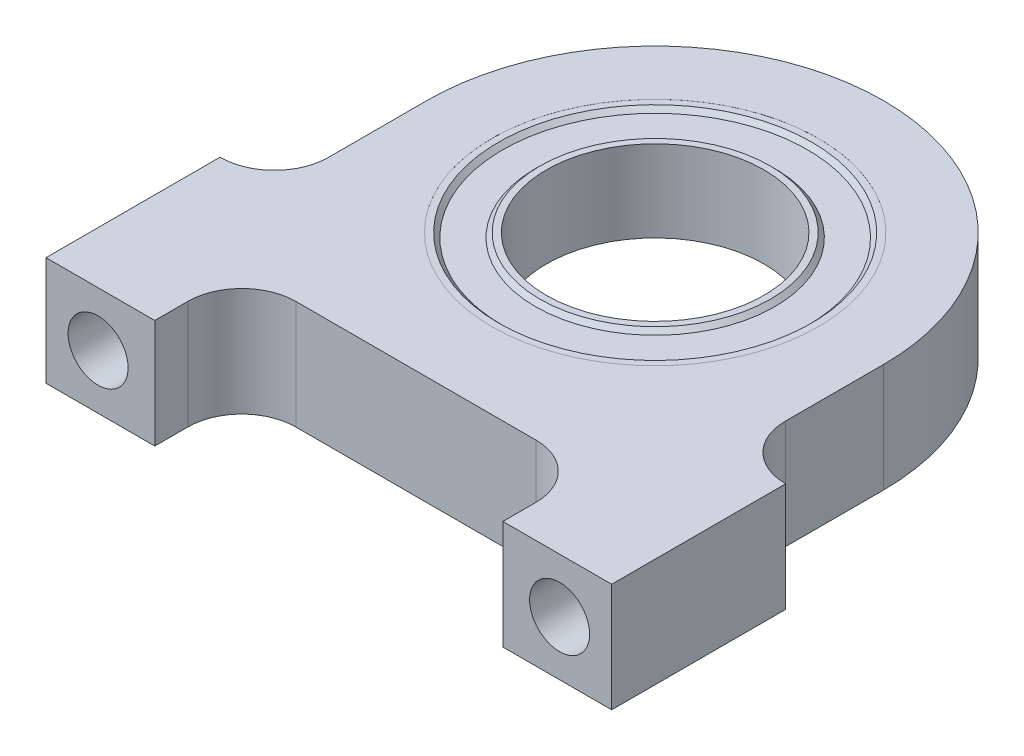
ISO-10303-21;
HEADER;
FILE_DESCRIPTION(('STEP AP214'),'2;1');
FILE_NAME('part.step','',(''),(''),'','','');
FILE_SCHEMA(('AUTOMOTIVE_DESIGN { 1 0 10303 214 1 1 1 1 }'));
ENDSEC;
DATA;
#1=APPLICATION_CONTEXT('core data for automotive mechanical design processes');
#2=APPLICATION_PROTOCOL_DEFINITION('international standard','automotive_design',2000,#1);
#3=PRODUCT_CONTEXT('',#1,'mechanical');
#4=PRODUCT('Part','Part','',(#3));
#5=PRODUCT_RELATED_PRODUCT_CATEGORY('part','',(#4));
#6=PRODUCT_DEFINITION_FORMATION('','',#4);
#7=PRODUCT_DEFINITION_CONTEXT('part definition',#1,'design');
#8=PRODUCT_DEFINITION('design','',#6,#7);
#9=PRODUCT_DEFINITION_SHAPE('','',#8);
#10=(LENGTH_UNIT() NAMED_UNIT(*) SI_UNIT(.MILLI.,.METRE.));
#11=(NAMED_UNIT(*) PLANE_ANGLE_UNIT() SI_UNIT($,.RADIAN.));
#12=(NAMED_UNIT(*) SI_UNIT($,.STERADIAN.) SOLID_ANGLE_UNIT());
#13=UNCERTAINTY_MEASURE_WITH_UNIT(LENGTH_MEASURE(1.E-05),#10,'distance_accuracy_value','');
#14=(GEOMETRIC_REPRESENTATION_CONTEXT(3) GLOBAL_UNCERTAINTY_ASSIGNED_CONTEXT((#13)) GLOBAL_UNIT_ASSIGNED_CONTEXT((#10,
#11,#12)) REPRESENTATION_CONTEXT('',''));
#15=CARTESIAN_POINT('',(0.,0.,0.));
#16=DIRECTION('',(0.,0.,1.));
#17=DIRECTION('',(1.,0.,0.));
#18=AXIS2_PLACEMENT_3D('',#15,#16,#17);
#19=CARTESIAN_POINT('',(0.,6.34746,0.));
#20=DIRECTION('',(0.,-1.,0.));
#21=DIRECTION('',(0.,0.,-1.));
#22=AXIS2_PLACEMENT_3D('',#19,#20,#21);
#23=CYLINDRICAL_SURFACE('',#22,8.89);
#24=CARTESIAN_POINT('',(0.,1.5875,0.));
#25=DIRECTION('',(0.,1.,0.));
#26=DIRECTION('',(0.,0.,1.));
#27=AXIS2_PLACEMENT_3D('',#24,#25,#26);
#28=CIRCLE('',#27,8.89);
#29=CARTESIAN_POINT('',(0.,1.5875,8.89));
#30=VERTEX_POINT('',#29);
#31=EDGE_CURVE('E253',#30,#30,#28,.F.);
#32=ORIENTED_EDGE('',*,*,#31,.T.);
#33=EDGE_LOOP('',(#32));
#34=FACE_BOUND('',#33,.T.);
#35=CARTESIAN_POINT('',(0.,1.8415,0.));
#36=DIRECTION('',(0.,1.,0.));
#37=DIRECTION('',(0.,0.,1.));
#38=AXIS2_PLACEMENT_3D('',#35,#36,#37);
#39=CIRCLE('',#38,8.89);
#40=CARTESIAN_POINT('',(0.,1.8415,8.89));
#41=VERTEX_POINT('',#40);
#42=EDGE_CURVE('E429',#41,#41,#39,.T.);
#43=ORIENTED_EDGE('',*,*,#42,.T.);
#44=EDGE_LOOP('',(#43));
#45=FACE_BOUND('',#44,.T.);
#46=ADVANCED_FACE('F34',(#34,#45),#23,.F.);
#47=CARTESIAN_POINT('',(0.,6.35,0.));
#48=DIRECTION('',(0.,-1.,0.));
#49=DIRECTION('',(0.,0.,-1.));
#50=AXIS2_PLACEMENT_3D('',#47,#48,#49);
#51=CYLINDRICAL_SURFACE('',#50,8.73125);
#52=CARTESIAN_POINT('',(0.,0.,0.));
#53=DIRECTION('',(0.,1.,0.));
#54=DIRECTION('',(0.,0.,1.));
#55=AXIS2_PLACEMENT_3D('',#52,#53,#54);
#56=CIRCLE('',#55,8.73125);
#57=CARTESIAN_POINT('',(0.,0.,8.73125));
#58=VERTEX_POINT('',#57);
#59=EDGE_CURVE('E187',#58,#58,#56,.T.);
#60=ORIENTED_EDGE('',*,*,#59,.F.);
#61=EDGE_LOOP('',(#60));
#62=FACE_BOUND('',#61,.T.);
#63=CARTESIAN_POINT('',(0.,1.5875,0.));
#64=DIRECTION('',(0.,1.,0.));
#65=DIRECTION('',(0.,0.,1.));
#66=AXIS2_PLACEMENT_3D('',#63,#64,#65);
#67=CIRCLE('',#66,8.73125);
#68=CARTESIAN_POINT('',(0.,1.5875,8.73125));
#69=VERTEX_POINT('',#68);
#70=EDGE_CURVE('E254',#69,#69,#67,.T.);
#71=ORIENTED_EDGE('',*,*,#70,.T.);
#72=EDGE_LOOP('',(#71));
#73=FACE_BOUND('',#72,.T.);
#74=ADVANCED_FACE('F279',(#62,#73),#51,.F.);
#75=CARTESIAN_POINT('',(-7.0104,6.35,17.1196));
#76=DIRECTION('',(0.,-1.,0.));
#77=DIRECTION('',(0.,0.,-1.));
#78=AXIS2_PLACEMENT_3D('',#75,#76,#77);
#79=PLANE('',#78);
#80=CARTESIAN_POINT('',(0.,6.35,0.));
#81=DIRECTION('',(0.,1.,0.));
#82=DIRECTION('',(0.,0.,1.));
#83=AXIS2_PLACEMENT_3D('',#80,#81,#82);
#84=CIRCLE('',#83,9.525);
#85=CARTESIAN_POINT('',(0.,6.35,9.525));
#86=VERTEX_POINT('',#85);
#87=EDGE_CURVE('E257',#86,#86,#84,.T.);
#88=ORIENTED_EDGE('',*,*,#87,.F.);
#89=EDGE_LOOP('',(#88));
#90=FACE_BOUND('',#89,.T.);
#91=DIRECTION('',(0.,0.,-1.));
#92=VECTOR('',#91,1.);
#93=CARTESIAN_POINT('',(-10.16,6.35,19.05));
#94=LINE('',#93,#92);
#95=CARTESIAN_POINT('',(-10.16,6.35,19.05));
#96=VERTEX_POINT('',#95);
#97=CARTESIAN_POINT('',(-10.16,6.35,17.1196));
#98=VERTEX_POINT('',#97);
#99=EDGE_CURVE('E214',#96,#98,#94,.T.);
#100=ORIENTED_EDGE('',*,*,#99,.T.);
#101=CARTESIAN_POINT('',(-7.0104,6.35,17.1196));
#102=DIRECTION('',(0.,-1.,0.));
#103=DIRECTION('',(0.,0.,-1.));
#104=AXIS2_PLACEMENT_3D('',#101,#102,#103);
#105=CIRCLE('',#104,3.1496);
#106=CARTESIAN_POINT('',(-7.0104,6.35,13.97));
#107=VERTEX_POINT('',#106);
#108=EDGE_CURVE('E120',#98,#107,#105,.T.);
#109=ORIENTED_EDGE('',*,*,#108,.T.);
#110=DIRECTION('',(1.,0.,0.));
#111=VECTOR('',#110,1.);
#112=CARTESIAN_POINT('',(-7.0104,6.35,13.97));
#113=LINE('',#112,#111);
#114=CARTESIAN_POINT('',(7.01040000000001,6.35,13.97));
#115=VERTEX_POINT('',#114);
#116=EDGE_CURVE('E371',#107,#115,#113,.T.);
#117=ORIENTED_EDGE('',*,*,#116,.T.);
#118=CARTESIAN_POINT('',(7.0104,6.35,17.1196));
#119=DIRECTION('',(0.,-1.,0.));
#120=DIRECTION('',(0.,0.,-1.));
#121=AXIS2_PLACEMENT_3D('',#118,#119,#120);
#122=CIRCLE('',#121,3.1496);
#123=CARTESIAN_POINT('',(10.16,6.35,17.1196));
#124=VERTEX_POINT('',#123);
#125=EDGE_CURVE('E373',#115,#124,#122,.T.);
#126=ORIENTED_EDGE('',*,*,#125,.T.);
#127=DIRECTION('',(0.,0.,1.));
#128=VECTOR('',#127,1.);
#129=CARTESIAN_POINT('',(10.16,6.35,17.1196));
#130=LINE('',#129,#128);
#131=CARTESIAN_POINT('',(10.16,6.35,19.05));
#132=VERTEX_POINT('',#131);
#133=EDGE_CURVE('E375',#124,#132,#130,.T.);
#134=ORIENTED_EDGE('',*,*,#133,.T.);
#135=DIRECTION('',(1.,0.,0.));
#136=VECTOR('',#135,1.);
#137=CARTESIAN_POINT('',(10.16,6.35,19.05));
#138=LINE('',#137,#136);
#139=CARTESIAN_POINT('',(16.51,6.35,19.05));
#140=VERTEX_POINT('',#139);
#141=EDGE_CURVE('E381',#132,#140,#138,.T.);
#142=ORIENTED_EDGE('',*,*,#141,.T.);
#143=DIRECTION('',(0.,0.,-1.));
#144=VECTOR('',#143,1.);
#145=CARTESIAN_POINT('',(16.51,6.35,19.05));
#146=LINE('',#145,#144);
#147=CARTESIAN_POINT('',(16.51,6.35,8.89));
#148=VERTEX_POINT('',#147);
#149=EDGE_CURVE('E383',#140,#148,#146,.T.);
#150=ORIENTED_EDGE('',*,*,#149,.T.);
#151=DIRECTION('',(-1.,0.,0.));
#152=VECTOR('',#151,1.);
#153=CARTESIAN_POINT('',(16.4846,6.35,8.89));
#154=LINE('',#153,#152);
#155=CARTESIAN_POINT('',(16.4846,6.35,8.89));
#156=VERTEX_POINT('',#155);
#157=EDGE_CURVE('E385',#148,#156,#154,.T.);
#158=ORIENTED_EDGE('',*,*,#157,.T.);
#159=CARTESIAN_POINT('',(16.4846,6.35,5.7404));
#160=DIRECTION('',(0.,-1.,0.));
#161=DIRECTION('',(0.,0.,1.));
#162=AXIS2_PLACEMENT_3D('',#159,#160,#161);
#163=CIRCLE('',#162,3.1496);
#164=CARTESIAN_POINT('',(13.335,6.35,5.74039999999998));
#165=VERTEX_POINT('',#164);
#166=EDGE_CURVE('E387',#156,#165,#163,.T.);
#167=ORIENTED_EDGE('',*,*,#166,.T.);
#168=DIRECTION('',(0.,0.,-1.));
#169=VECTOR('',#168,1.);
#170=CARTESIAN_POINT('',(13.335,6.35,0.));
#171=LINE('',#170,#169);
#172=CARTESIAN_POINT('',(13.335,6.35,0.));
#173=VERTEX_POINT('',#172);
#174=EDGE_CURVE('E389',#165,#173,#171,.T.);
#175=ORIENTED_EDGE('',*,*,#174,.T.);
#176=CARTESIAN_POINT('',(0.,6.35,0.));
#177=DIRECTION('',(0.,1.,0.));
#178=DIRECTION('',(0.,0.,1.));
#179=AXIS2_PLACEMENT_3D('',#176,#177,#178);
#180=CIRCLE('',#179,13.335);
#181=CARTESIAN_POINT('',(-13.335,6.35,0.));
#182=VERTEX_POINT('',#181);
#183=EDGE_CURVE('E391',#173,#182,#180,.T.);
#184=ORIENTED_EDGE('',*,*,#183,.T.);
#185=DIRECTION('',(0.,0.,1.));
#186=VECTOR('',#185,1.);
#187=CARTESIAN_POINT('',(-13.335,6.35,0.));
#188=LINE('',#187,#186);
#189=CARTESIAN_POINT('',(-13.335,6.35,5.74039999999998));
#190=VERTEX_POINT('',#189);
#191=EDGE_CURVE('E393',#182,#190,#188,.T.);
#192=ORIENTED_EDGE('',*,*,#191,.T.);
#193=CARTESIAN_POINT('',(-16.4846,6.35,5.7404));
#194=DIRECTION('',(0.,-1.,0.));
#195=DIRECTION('',(0.,0.,-1.));
#196=AXIS2_PLACEMENT_3D('',#193,#194,#195);
#197=CIRCLE('',#196,3.1496);
#198=CARTESIAN_POINT('',(-16.4846,6.35,8.89));
#199=VERTEX_POINT('',#198);
#200=EDGE_CURVE('E165',#190,#199,#197,.T.);
#201=ORIENTED_EDGE('',*,*,#200,.T.);
#202=DIRECTION('',(-1.,0.,0.));
#203=VECTOR('',#202,1.);
#204=CARTESIAN_POINT('',(-16.51,6.35,8.89));
#205=LINE('',#204,#203);
#206=CARTESIAN_POINT('',(-16.51,6.35,8.89));
#207=VERTEX_POINT('',#206);
#208=EDGE_CURVE('E159',#199,#207,#205,.T.);
#209=ORIENTED_EDGE('',*,*,#208,.T.);
#210=DIRECTION('',(0.,0.,1.));
#211=VECTOR('',#210,1.);
#212=CARTESIAN_POINT('',(-16.51,6.35,19.05));
#213=LINE('',#212,#211);
#214=CARTESIAN_POINT('',(-16.51,6.35,19.05));
#215=VERTEX_POINT('',#214);
#216=EDGE_CURVE('E163',#207,#215,#213,.T.);
#217=ORIENTED_EDGE('',*,*,#216,.T.);
#218=DIRECTION('',(1.,0.,0.));
#219=VECTOR('',#218,1.);
#220=CARTESIAN_POINT('',(-16.51,6.35,19.05));
#221=LINE('',#220,#219);
#222=EDGE_CURVE('E51',#215,#96,#221,.T.);
#223=ORIENTED_EDGE('',*,*,#222,.T.);
#224=EDGE_LOOP('',(#100,#109,#117,#126,#134,#142,#150,#158,#167,#175,#184,#192,#201,#209,#217,#223));
#225=FACE_BOUND('',#224,.T.);
#226=ADVANCED_FACE('F161',(#90,#225),#79,.F.);
#227=CARTESIAN_POINT('',(-7.0104,0.,17.1196));
#228=DIRECTION('',(0.,-1.,0.));
#229=DIRECTION('',(0.,0.,-1.));
#230=AXIS2_PLACEMENT_3D('',#227,#228,#229);
#231=PLANE('',#230);
#232=DIRECTION('',(0.,0.,-1.));
#233=VECTOR('',#232,1.);
#234=CARTESIAN_POINT('',(-10.16,0.,19.05));
#235=LINE('',#234,#233);
#236=CARTESIAN_POINT('',(-10.16,0.,19.05));
#237=VERTEX_POINT('',#236);
#238=CARTESIAN_POINT('',(-10.16,0.,17.1196));
#239=VERTEX_POINT('',#238);
#240=EDGE_CURVE('E183',#237,#239,#235,.T.);
#241=ORIENTED_EDGE('',*,*,#240,.F.);
#242=DIRECTION('',(1.,0.,0.));
#243=VECTOR('',#242,1.);
#244=CARTESIAN_POINT('',(-16.51,0.,19.05));
#245=LINE('',#244,#243);
#246=CARTESIAN_POINT('',(-16.51,0.,19.05));
#247=VERTEX_POINT('',#246);
#248=EDGE_CURVE('E111',#247,#237,#245,.T.);
#249=ORIENTED_EDGE('',*,*,#248,.F.);
#250=DIRECTION('',(0.,0.,1.));
#251=VECTOR('',#250,1.);
#252=CARTESIAN_POINT('',(-16.51,0.,19.05));
#253=LINE('',#252,#251);
#254=CARTESIAN_POINT('',(-16.51,0.,8.89));
#255=VERTEX_POINT('',#254);
#256=EDGE_CURVE('E105',#255,#247,#253,.T.);
#257=ORIENTED_EDGE('',*,*,#256,.F.);
#258=DIRECTION('',(-1.,0.,0.));
#259=VECTOR('',#258,1.);
#260=CARTESIAN_POINT('',(-16.51,0.,8.89));
#261=LINE('',#260,#259);
#262=CARTESIAN_POINT('',(-16.4846,0.,8.89));
#263=VERTEX_POINT('',#262);
#264=EDGE_CURVE('E173',#263,#255,#261,.T.);
#265=ORIENTED_EDGE('',*,*,#264,.F.);
#266=CARTESIAN_POINT('',(-16.4846,0.,5.7404));
#267=DIRECTION('',(0.,-1.,0.));
#268=DIRECTION('',(0.,0.,-1.));
#269=AXIS2_PLACEMENT_3D('',#266,#267,#268);
#270=CIRCLE('',#269,3.1496);
#271=CARTESIAN_POINT('',(-13.335,0.,5.74039999999998));
#272=VERTEX_POINT('',#271);
#273=EDGE_CURVE('E209',#272,#263,#270,.T.);
#274=ORIENTED_EDGE('',*,*,#273,.F.);
#275=DIRECTION('',(0.,0.,1.));
#276=VECTOR('',#275,1.);
#277=CARTESIAN_POINT('',(-13.335,0.,0.));
#278=LINE('',#277,#276);
#279=CARTESIAN_POINT('',(-13.335,0.,0.));
#280=VERTEX_POINT('',#279);
#281=EDGE_CURVE('E207',#280,#272,#278,.T.);
#282=ORIENTED_EDGE('',*,*,#281,.F.);
#283=CARTESIAN_POINT('',(0.,0.,0.));
#284=DIRECTION('',(0.,1.,0.));
#285=DIRECTION('',(0.,0.,1.));
#286=AXIS2_PLACEMENT_3D('',#283,#284,#285);
#287=CIRCLE('',#286,13.335);
#288=CARTESIAN_POINT('',(13.335,0.,0.));
#289=VERTEX_POINT('',#288);
#290=EDGE_CURVE('E205',#289,#280,#287,.T.);
#291=ORIENTED_EDGE('',*,*,#290,.F.);
#292=DIRECTION('',(0.,0.,-1.));
#293=VECTOR('',#292,1.);
#294=CARTESIAN_POINT('',(13.335,0.,0.));
#295=LINE('',#294,#293);
#296=CARTESIAN_POINT('',(13.335,0.,5.74039999999998));
#297=VERTEX_POINT('',#296);
#298=EDGE_CURVE('E203',#297,#289,#295,.T.);
#299=ORIENTED_EDGE('',*,*,#298,.F.);
#300=CARTESIAN_POINT('',(16.4846,0.,5.7404));
#301=DIRECTION('',(0.,-1.,0.));
#302=DIRECTION('',(0.,0.,1.));
#303=AXIS2_PLACEMENT_3D('',#300,#301,#302);
#304=CIRCLE('',#303,3.1496);
#305=CARTESIAN_POINT('',(16.4846,0.,8.89));
#306=VERTEX_POINT('',#305);
#307=EDGE_CURVE('E201',#306,#297,#304,.T.);
#308=ORIENTED_EDGE('',*,*,#307,.F.);
#309=DIRECTION('',(-1.,0.,0.));
#310=VECTOR('',#309,1.);
#311=CARTESIAN_POINT('',(16.4846,0.,8.89));
#312=LINE('',#311,#310);
#313=CARTESIAN_POINT('',(16.51,0.,8.89));
#314=VERTEX_POINT('',#313);
#315=EDGE_CURVE('E199',#314,#306,#312,.T.);
#316=ORIENTED_EDGE('',*,*,#315,.F.);
#317=DIRECTION('',(0.,0.,-1.));
#318=VECTOR('',#317,1.);
#319=CARTESIAN_POINT('',(16.51,0.,19.05));
#320=LINE('',#319,#318);
#321=CARTESIAN_POINT('',(16.51,0.,19.05));
#322=VERTEX_POINT('',#321);
#323=EDGE_CURVE('E197',#322,#314,#320,.T.);
#324=ORIENTED_EDGE('',*,*,#323,.F.);
#325=DIRECTION('',(1.,0.,0.));
#326=VECTOR('',#325,1.);
#327=CARTESIAN_POINT('',(10.16,0.,19.05));
#328=LINE('',#327,#326);
#329=CARTESIAN_POINT('',(10.16,0.,19.05));
#330=VERTEX_POINT('',#329);
#331=EDGE_CURVE('E195',#330,#322,#328,.T.);
#332=ORIENTED_EDGE('',*,*,#331,.F.);
#333=DIRECTION('',(0.,0.,1.));
#334=VECTOR('',#333,1.);
#335=CARTESIAN_POINT('',(10.16,0.,17.1196));
#336=LINE('',#335,#334);
#337=CARTESIAN_POINT('',(10.16,0.,17.1196));
#338=VERTEX_POINT('',#337);
#339=EDGE_CURVE('E193',#338,#330,#336,.T.);
#340=ORIENTED_EDGE('',*,*,#339,.F.);
#341=CARTESIAN_POINT('',(7.0104,0.,17.1196));
#342=DIRECTION('',(0.,-1.,0.));
#343=DIRECTION('',(0.,0.,-1.));
#344=AXIS2_PLACEMENT_3D('',#341,#342,#343);
#345=CIRCLE('',#344,3.1496);
#346=CARTESIAN_POINT('',(7.01040000000001,0.,13.97));
#347=VERTEX_POINT('',#346);
#348=EDGE_CURVE('E191',#347,#338,#345,.T.);
#349=ORIENTED_EDGE('',*,*,#348,.F.);
#350=DIRECTION('',(1.,0.,0.));
#351=VECTOR('',#350,1.);
#352=CARTESIAN_POINT('',(-7.0104,0.,13.97));
#353=LINE('',#352,#351);
#354=CARTESIAN_POINT('',(-7.0104,0.,13.97));
#355=VERTEX_POINT('',#354);
#356=EDGE_CURVE('E189',#355,#347,#353,.T.);
#357=ORIENTED_EDGE('',*,*,#356,.F.);
#358=CARTESIAN_POINT('',(-7.0104,0.,17.1196));
#359=DIRECTION('',(0.,-1.,0.));
#360=DIRECTION('',(0.,0.,-1.));
#361=AXIS2_PLACEMENT_3D('',#358,#359,#360);
#362=CIRCLE('',#361,3.1496);
#363=EDGE_CURVE('E186',#239,#355,#362,.T.);
#364=ORIENTED_EDGE('',*,*,#363,.F.);
#365=EDGE_LOOP('',(#241,#249,#257,#265,#274,#282,#291,#299,#308,#316,#324,#332,#340,#349,#357,#364));
#366=FACE_BOUND('',#365,.T.);
#367=ORIENTED_EDGE('',*,*,#59,.T.);
#368=EDGE_LOOP('',(#367));
#369=FACE_BOUND('',#368,.T.);
#370=ADVANCED_FACE('F300',(#366,#369),#231,.T.);
#371=CARTESIAN_POINT('',(-10.16,6.35,19.05));
#372=DIRECTION('',(-1.,0.,0.));
#373=DIRECTION('',(0.,0.,1.));
#374=AXIS2_PLACEMENT_3D('',#371,#372,#373);
#375=PLANE('',#374);
#376=ORIENTED_EDGE('',*,*,#240,.T.);
#377=DIRECTION('',(0.,-1.,0.));
#378=VECTOR('',#377,1.);
#379=CARTESIAN_POINT('',(-10.16,6.35,17.1196));
#380=LINE('',#379,#378);
#381=EDGE_CURVE('E251',#98,#239,#380,.T.);
#382=ORIENTED_EDGE('',*,*,#381,.F.);
#383=ORIENTED_EDGE('',*,*,#99,.F.);
#384=DIRECTION('',(0.,-1.,0.));
#385=VECTOR('',#384,1.);
#386=CARTESIAN_POINT('',(-10.16,6.35,19.05));
#387=LINE('',#386,#385);
#388=EDGE_CURVE('E179',#96,#237,#387,.T.);
#389=ORIENTED_EDGE('',*,*,#388,.T.);
#390=EDGE_LOOP('',(#376,#382,#383,#389));
#391=FACE_BOUND('',#390,.T.);
#392=ADVANCED_FACE('F304',(#391),#375,.F.);
#393=CARTESIAN_POINT('',(-7.0104,6.35,17.1196));
#394=DIRECTION('',(0.,-1.,0.));
#395=DIRECTION('',(0.,0.,-1.));
#396=AXIS2_PLACEMENT_3D('',#393,#394,#395);
#397=CYLINDRICAL_SURFACE('',#396,3.1496);
#398=ORIENTED_EDGE('',*,*,#363,.T.);
#399=DIRECTION('',(0.,-1.,0.));
#400=VECTOR('',#399,1.);
#401=CARTESIAN_POINT('',(-7.0104,6.35,13.97));
#402=LINE('',#401,#400);
#403=EDGE_CURVE('E248',#107,#355,#402,.T.);
#404=ORIENTED_EDGE('',*,*,#403,.F.);
#405=ORIENTED_EDGE('',*,*,#108,.F.);
#406=ORIENTED_EDGE('',*,*,#381,.T.);
#407=EDGE_LOOP('',(#398,#404,#405,#406));
#408=FACE_BOUND('',#407,.T.);
#409=ADVANCED_FACE('F356',(#408),#397,.F.);
#410=CARTESIAN_POINT('',(-7.0104,6.35,13.97));
#411=DIRECTION('',(0.,0.,-1.));
#412=DIRECTION('',(-1.,0.,0.));
#413=AXIS2_PLACEMENT_3D('',#410,#411,#412);
#414=PLANE('',#413);
#415=ORIENTED_EDGE('',*,*,#356,.T.);
#416=DIRECTION('',(0.,-1.,0.));
#417=VECTOR('',#416,1.);
#418=CARTESIAN_POINT('',(7.01040000000001,6.35,13.97));
#419=LINE('',#418,#417);
#420=EDGE_CURVE('E245',#115,#347,#419,.T.);
#421=ORIENTED_EDGE('',*,*,#420,.F.);
#422=ORIENTED_EDGE('',*,*,#116,.F.);
#423=ORIENTED_EDGE('',*,*,#403,.T.);
#424=EDGE_LOOP('',(#415,#421,#422,#423));
#425=FACE_BOUND('',#424,.T.);
#426=ADVANCED_FACE('F352',(#425),#414,.F.);
#427=CARTESIAN_POINT('',(7.0104,6.35,17.1196));
#428=DIRECTION('',(0.,-1.,0.));
#429=DIRECTION('',(0.,0.,-1.));
#430=AXIS2_PLACEMENT_3D('',#427,#428,#429);
#431=CYLINDRICAL_SURFACE('',#430,3.1496);
#432=ORIENTED_EDGE('',*,*,#348,.T.);
#433=DIRECTION('',(0.,-1.,0.));
#434=VECTOR('',#433,1.);
#435=CARTESIAN_POINT('',(10.16,6.35,17.1196));
#436=LINE('',#435,#434);
#437=EDGE_CURVE('E242',#124,#338,#436,.T.);
#438=ORIENTED_EDGE('',*,*,#437,.F.);
#439=ORIENTED_EDGE('',*,*,#125,.F.);
#440=ORIENTED_EDGE('',*,*,#420,.T.);
#441=EDGE_LOOP('',(#432,#438,#439,#440));
#442=FACE_BOUND('',#441,.T.);
#443=ADVANCED_FACE('F348',(#442),#431,.F.);
#444=CARTESIAN_POINT('',(10.16,6.35,17.1196));
#445=DIRECTION('',(1.,0.,0.));
#446=DIRECTION('',(0.,0.,-1.));
#447=AXIS2_PLACEMENT_3D('',#444,#445,#446);
#448=PLANE('',#447);
#449=ORIENTED_EDGE('',*,*,#339,.T.);
#450=DIRECTION('',(0.,-1.,0.));
#451=VECTOR('',#450,1.);
#452=CARTESIAN_POINT('',(10.16,6.35,19.05));
#453=LINE('',#452,#451);
#454=EDGE_CURVE('E239',#132,#330,#453,.T.);
#455=ORIENTED_EDGE('',*,*,#454,.F.);
#456=ORIENTED_EDGE('',*,*,#133,.F.);
#457=ORIENTED_EDGE('',*,*,#437,.T.);
#458=EDGE_LOOP('',(#449,#455,#456,#457));
#459=FACE_BOUND('',#458,.T.);
#460=ADVANCED_FACE('F344',(#459),#448,.F.);
#461=CARTESIAN_POINT('',(10.16,6.35,19.05));
#462=DIRECTION('',(0.,0.,-1.));
#463=DIRECTION('',(-1.,0.,0.));
#464=AXIS2_PLACEMENT_3D('',#461,#462,#463);
#465=PLANE('',#464);
#466=CARTESIAN_POINT('',(13.4703841816037,3.175,19.05));
#467=DIRECTION('',(0.,0.,1.));
#468=DIRECTION('',(1.,0.,0.));
#469=AXIS2_PLACEMENT_3D('',#466,#467,#468);
#470=CIRCLE('',#469,1.75259999999999);
#471=CARTESIAN_POINT('',(15.2229841816037,3.175,19.05));
#472=VERTEX_POINT('',#471);
#473=EDGE_CURVE('E459',#472,#472,#470,.T.);
#474=ORIENTED_EDGE('',*,*,#473,.F.);
#475=EDGE_LOOP('',(#474));
#476=FACE_BOUND('',#475,.T.);
#477=ORIENTED_EDGE('',*,*,#331,.T.);
#478=DIRECTION('',(0.,-1.,0.));
#479=VECTOR('',#478,1.);
#480=CARTESIAN_POINT('',(16.51,6.35,19.05));
#481=LINE('',#480,#479);
#482=EDGE_CURVE('E236',#140,#322,#481,.T.);
#483=ORIENTED_EDGE('',*,*,#482,.F.);
#484=ORIENTED_EDGE('',*,*,#141,.F.);
#485=ORIENTED_EDGE('',*,*,#454,.T.);
#486=EDGE_LOOP('',(#477,#483,#484,#485));
#487=FACE_BOUND('',#486,.T.);
#488=ADVANCED_FACE('F340',(#476,#487),#465,.F.);
#489=CARTESIAN_POINT('',(16.51,6.35,19.05));
#490=DIRECTION('',(-1.,0.,0.));
#491=DIRECTION('',(0.,0.,1.));
#492=AXIS2_PLACEMENT_3D('',#489,#490,#491);
#493=PLANE('',#492);
#494=ORIENTED_EDGE('',*,*,#323,.T.);
#495=DIRECTION('',(0.,-1.,0.));
#496=VECTOR('',#495,1.);
#497=CARTESIAN_POINT('',(16.51,6.35,8.89));
#498=LINE('',#497,#496);
#499=EDGE_CURVE('E233',#148,#314,#498,.T.);
#500=ORIENTED_EDGE('',*,*,#499,.F.);
#501=ORIENTED_EDGE('',*,*,#149,.F.);
#502=ORIENTED_EDGE('',*,*,#482,.T.);
#503=EDGE_LOOP('',(#494,#500,#501,#502));
#504=FACE_BOUND('',#503,.T.);
#505=ADVANCED_FACE('F336',(#504),#493,.F.);
#506=CARTESIAN_POINT('',(16.4846,6.35,8.89));
#507=DIRECTION('',(0.,0.,1.));
#508=DIRECTION('',(1.,0.,0.));
#509=AXIS2_PLACEMENT_3D('',#506,#507,#508);
#510=PLANE('',#509);
#511=ORIENTED_EDGE('',*,*,#315,.T.);
#512=DIRECTION('',(0.,-1.,0.));
#513=VECTOR('',#512,1.);
#514=CARTESIAN_POINT('',(16.4846,6.35,8.89));
#515=LINE('',#514,#513);
#516=EDGE_CURVE('E230',#156,#306,#515,.T.);
#517=ORIENTED_EDGE('',*,*,#516,.F.);
#518=ORIENTED_EDGE('',*,*,#157,.F.);
#519=ORIENTED_EDGE('',*,*,#499,.T.);
#520=EDGE_LOOP('',(#511,#517,#518,#519));
#521=FACE_BOUND('',#520,.T.);
#522=ADVANCED_FACE('F332',(#521),#510,.F.);
#523=CARTESIAN_POINT('',(16.4846,6.35,5.7404));
#524=DIRECTION('',(0.,-1.,0.));
#525=DIRECTION('',(0.,0.,-1.));
#526=AXIS2_PLACEMENT_3D('',#523,#524,#525);
#527=CYLINDRICAL_SURFACE('',#526,3.1496);
#528=ORIENTED_EDGE('',*,*,#307,.T.);
#529=DIRECTION('',(0.,-1.,0.));
#530=VECTOR('',#529,1.);
#531=CARTESIAN_POINT('',(13.335,6.35,5.74039999999998));
#532=LINE('',#531,#530);
#533=EDGE_CURVE('E227',#165,#297,#532,.T.);
#534=ORIENTED_EDGE('',*,*,#533,.F.);
#535=ORIENTED_EDGE('',*,*,#166,.F.);
#536=ORIENTED_EDGE('',*,*,#516,.T.);
#537=EDGE_LOOP('',(#528,#534,#535,#536));
#538=FACE_BOUND('',#537,.T.);
#539=ADVANCED_FACE('F328',(#538),#527,.F.);
#540=CARTESIAN_POINT('',(13.335,6.35,0.));
#541=DIRECTION('',(-1.,0.,0.));
#542=DIRECTION('',(0.,0.,1.));
#543=AXIS2_PLACEMENT_3D('',#540,#541,#542);
#544=PLANE('',#543);
#545=ORIENTED_EDGE('',*,*,#298,.T.);
#546=DIRECTION('',(0.,-1.,0.));
#547=VECTOR('',#546,1.);
#548=CARTESIAN_POINT('',(13.335,6.35,0.));
#549=LINE('',#548,#547);
#550=EDGE_CURVE('E224',#173,#289,#549,.T.);
#551=ORIENTED_EDGE('',*,*,#550,.F.);
#552=ORIENTED_EDGE('',*,*,#174,.F.);
#553=ORIENTED_EDGE('',*,*,#533,.T.);
#554=EDGE_LOOP('',(#545,#551,#552,#553));
#555=FACE_BOUND('',#554,.T.);
#556=ADVANCED_FACE('F324',(#555),#544,.F.);
#557=CARTESIAN_POINT('',(0.,6.35,0.));
#558=DIRECTION('',(0.,-1.,0.));
#559=DIRECTION('',(0.,0.,-1.));
#560=AXIS2_PLACEMENT_3D('',#557,#558,#559);
#561=CYLINDRICAL_SURFACE('',#560,13.335);
#562=ORIENTED_EDGE('',*,*,#290,.T.);
#563=DIRECTION('',(0.,-1.,0.));
#564=VECTOR('',#563,1.);
#565=CARTESIAN_POINT('',(-13.335,6.35,0.));
#566=LINE('',#565,#564);
#567=EDGE_CURVE('E221',#182,#280,#566,.T.);
#568=ORIENTED_EDGE('',*,*,#567,.F.);
#569=ORIENTED_EDGE('',*,*,#183,.F.);
#570=ORIENTED_EDGE('',*,*,#550,.T.);
#571=EDGE_LOOP('',(#562,#568,#569,#570));
#572=FACE_BOUND('',#571,.T.);
#573=ADVANCED_FACE('F320',(#572),#561,.T.);
#574=CARTESIAN_POINT('',(-13.335,6.35,0.));
#575=DIRECTION('',(1.,0.,0.));
#576=DIRECTION('',(0.,0.,-1.));
#577=AXIS2_PLACEMENT_3D('',#574,#575,#576);
#578=PLANE('',#577);
#579=ORIENTED_EDGE('',*,*,#281,.T.);
#580=DIRECTION('',(0.,-1.,0.));
#581=VECTOR('',#580,1.);
#582=CARTESIAN_POINT('',(-13.335,6.35,5.74039999999998));
#583=LINE('',#582,#581);
#584=EDGE_CURVE('E218',#190,#272,#583,.T.);
#585=ORIENTED_EDGE('',*,*,#584,.F.);
#586=ORIENTED_EDGE('',*,*,#191,.F.);
#587=ORIENTED_EDGE('',*,*,#567,.T.);
#588=EDGE_LOOP('',(#579,#585,#586,#587));
#589=FACE_BOUND('',#588,.T.);
#590=ADVANCED_FACE('F316',(#589),#578,.F.);
#591=CARTESIAN_POINT('',(-16.4846,6.35,5.7404));
#592=DIRECTION('',(0.,-1.,0.));
#593=DIRECTION('',(0.,0.,-1.));
#594=AXIS2_PLACEMENT_3D('',#591,#592,#593);
#595=CYLINDRICAL_SURFACE('',#594,3.1496);
#596=ORIENTED_EDGE('',*,*,#273,.T.);
#597=DIRECTION('',(0.,-1.,0.));
#598=VECTOR('',#597,1.);
#599=CARTESIAN_POINT('',(-16.4846,6.35,8.89));
#600=LINE('',#599,#598);
#601=EDGE_CURVE('E174',#199,#263,#600,.T.);
#602=ORIENTED_EDGE('',*,*,#601,.F.);
#603=ORIENTED_EDGE('',*,*,#200,.F.);
#604=ORIENTED_EDGE('',*,*,#584,.T.);
#605=EDGE_LOOP('',(#596,#602,#603,#604));
#606=FACE_BOUND('',#605,.T.);
#607=ADVANCED_FACE('F313',(#606),#595,.F.);
#608=CARTESIAN_POINT('',(-16.51,6.35,8.89));
#609=DIRECTION('',(0.,0.,1.));
#610=DIRECTION('',(1.,0.,0.));
#611=AXIS2_PLACEMENT_3D('',#608,#609,#610);
#612=PLANE('',#611);
#613=ORIENTED_EDGE('',*,*,#264,.T.);
#614=DIRECTION('',(0.,-1.,0.));
#615=VECTOR('',#614,1.);
#616=CARTESIAN_POINT('',(-16.51,6.35,8.89));
#617=LINE('',#616,#615);
#618=EDGE_CURVE('E170',#207,#255,#617,.T.);
#619=ORIENTED_EDGE('',*,*,#618,.F.);
#620=ORIENTED_EDGE('',*,*,#208,.F.);
#621=ORIENTED_EDGE('',*,*,#601,.T.);
#622=EDGE_LOOP('',(#613,#619,#620,#621));
#623=FACE_BOUND('',#622,.T.);
#624=ADVANCED_FACE('F171',(#623),#612,.F.);
#625=CARTESIAN_POINT('',(-16.51,6.35,19.05));
#626=DIRECTION('',(1.,0.,0.));
#627=DIRECTION('',(0.,0.,-1.));
#628=AXIS2_PLACEMENT_3D('',#625,#626,#627);
#629=PLANE('',#628);
#630=ORIENTED_EDGE('',*,*,#256,.T.);
#631=DIRECTION('',(0.,-1.,0.));
#632=VECTOR('',#631,1.);
#633=CARTESIAN_POINT('',(-16.51,6.35,19.05));
#634=LINE('',#633,#632);
#635=EDGE_CURVE('E175',#215,#247,#634,.T.);
#636=ORIENTED_EDGE('',*,*,#635,.F.);
#637=ORIENTED_EDGE('',*,*,#216,.F.);
#638=ORIENTED_EDGE('',*,*,#618,.T.);
#639=EDGE_LOOP('',(#630,#636,#637,#638));
#640=FACE_BOUND('',#639,.T.);
#641=ADVANCED_FACE('F177',(#640),#629,.F.);
#642=CARTESIAN_POINT('',(-16.51,6.35,19.05));
#643=DIRECTION('',(0.,0.,-1.));
#644=DIRECTION('',(-1.,0.,0.));
#645=AXIS2_PLACEMENT_3D('',#642,#643,#644);
#646=PLANE('',#645);
#647=CARTESIAN_POINT('',(-13.4703841816037,3.175,19.05));
#648=DIRECTION('',(0.,0.,1.));
#649=DIRECTION('',(1.,0.,0.));
#650=AXIS2_PLACEMENT_3D('',#647,#648,#649);
#651=CIRCLE('',#650,1.75259999999999);
#652=CARTESIAN_POINT('',(-11.7177841816037,3.175,19.05));
#653=VERTEX_POINT('',#652);
#654=EDGE_CURVE('E471',#653,#653,#651,.T.);
#655=ORIENTED_EDGE('',*,*,#654,.F.);
#656=EDGE_LOOP('',(#655));
#657=FACE_BOUND('',#656,.T.);
#658=ORIENTED_EDGE('',*,*,#248,.T.);
#659=ORIENTED_EDGE('',*,*,#388,.F.);
#660=ORIENTED_EDGE('',*,*,#222,.F.);
#661=ORIENTED_EDGE('',*,*,#635,.T.);
#662=EDGE_LOOP('',(#658,#659,#660,#661));
#663=FACE_BOUND('',#662,.T.);
#664=ADVANCED_FACE('F295',(#657,#663),#646,.F.);
#665=CARTESIAN_POINT('',(0.,1.5875,0.));
#666=DIRECTION('',(0.,1.,0.));
#667=DIRECTION('',(0.,0.,1.));
#668=AXIS2_PLACEMENT_3D('',#665,#666,#667);
#669=CYLINDRICAL_SURFACE('',#668,9.525);
#670=CARTESIAN_POINT('',(0.,6.34746,0.));
#671=DIRECTION('',(0.,1.,0.));
#672=DIRECTION('',(0.,0.,1.));
#673=AXIS2_PLACEMENT_3D('',#670,#671,#672);
#674=CIRCLE('',#673,9.525);
#675=CARTESIAN_POINT('',(0.,6.34746,9.525));
#676=VERTEX_POINT('',#675);
#677=EDGE_CURVE('E426',#676,#676,#674,.T.);
#678=ORIENTED_EDGE('',*,*,#677,.F.);
#679=EDGE_LOOP('',(#678));
#680=FACE_BOUND('',#679,.T.);
#681=ORIENTED_EDGE('',*,*,#87,.T.);
#682=EDGE_LOOP('',(#681));
#683=FACE_BOUND('',#682,.T.);
#684=ADVANCED_FACE('F292',(#680,#683),#669,.F.);
#685=CARTESIAN_POINT('',(0.,1.5875,0.));
#686=DIRECTION('',(0.,1.,0.));
#687=DIRECTION('',(0.,0.,1.));
#688=AXIS2_PLACEMENT_3D('',#685,#686,#687);
#689=PLANE('',#688);
#690=ORIENTED_EDGE('',*,*,#31,.F.);
#691=EDGE_LOOP('',(#690));
#692=FACE_BOUND('',#691,.T.);
#693=ORIENTED_EDGE('',*,*,#70,.F.);
#694=EDGE_LOOP('',(#693));
#695=FACE_BOUND('',#694,.T.);
#696=ADVANCED_FACE('F274',(#692,#695),#689,.T.);
#697=CARTESIAN_POINT('',(0.,6.34746,0.));
#698=DIRECTION('',(0.,1.,0.));
#699=DIRECTION('',(0.,0.,1.));
#700=AXIS2_PLACEMENT_3D('',#697,#698,#699);
#701=PLANE('',#700);
#702=CARTESIAN_POINT('',(0.,6.34746,0.));
#703=DIRECTION('',(0.,1.,0.));
#704=DIRECTION('',(0.,0.,1.));
#705=AXIS2_PLACEMENT_3D('',#702,#703,#704);
#706=CIRCLE('',#705,9.144);
#707=CARTESIAN_POINT('',(0.,6.34746,9.144));
#708=VERTEX_POINT('',#707);
#709=EDGE_CURVE('E11',#708,#708,#706,.F.);
#710=ORIENTED_EDGE('',*,*,#709,.T.);
#711=EDGE_LOOP('',(#710));
#712=FACE_BOUND('',#711,.T.);
#713=ORIENTED_EDGE('',*,*,#677,.T.);
#714=EDGE_LOOP('',(#713));
#715=FACE_BOUND('',#714,.T.);
#716=ADVANCED_FACE('F266',(#712,#715),#701,.T.);
#717=CARTESIAN_POINT('',(0.,6.09346,0.));
#718=DIRECTION('',(0.,1.,0.));
#719=DIRECTION('',(0.,0.,1.));
#720=AXIS2_PLACEMENT_3D('',#717,#718,#719);
#721=CONICAL_SURFACE('',#720,8.89,0.785398163397455);
#722=ORIENTED_EDGE('',*,*,#709,.F.);
#723=EDGE_LOOP('',(#722));
#724=FACE_BOUND('',#723,.T.);
#725=CARTESIAN_POINT('',(0.,6.09346,0.));
#726=DIRECTION('',(0.,1.,0.));
#727=DIRECTION('',(0.,0.,1.));
#728=AXIS2_PLACEMENT_3D('',#725,#726,#727);
#729=CIRCLE('',#728,8.89);
#730=CARTESIAN_POINT('',(0.,6.09346,8.89));
#731=VERTEX_POINT('',#730);
#732=EDGE_CURVE('E43',#731,#731,#729,.T.);
#733=ORIENTED_EDGE('',*,*,#732,.F.);
#734=EDGE_LOOP('',(#733));
#735=FACE_BOUND('',#734,.T.);
#736=ADVANCED_FACE('F36',(#724,#735),#721,.F.);
#737=CARTESIAN_POINT('',(0.,1.8415,0.));
#738=DIRECTION('',(0.,1.,0.));
#739=DIRECTION('',(0.,0.,1.));
#740=AXIS2_PLACEMENT_3D('',#737,#738,#739);
#741=PLANE('',#740);
#742=CARTESIAN_POINT('',(0.,1.8415,0.));
#743=DIRECTION('',(0.,1.,0.));
#744=DIRECTION('',(0.,0.,1.));
#745=AXIS2_PLACEMENT_3D('',#742,#743,#744);
#746=CIRCLE('',#745,6.985);
#747=CARTESIAN_POINT('',(0.,1.8415,6.985));
#748=VERTEX_POINT('',#747);
#749=EDGE_CURVE('E438',#748,#748,#746,.T.);
#750=ORIENTED_EDGE('',*,*,#749,.T.);
#751=EDGE_LOOP('',(#750));
#752=FACE_BOUND('',#751,.T.);
#753=ORIENTED_EDGE('',*,*,#42,.F.);
#754=EDGE_LOOP('',(#753));
#755=FACE_BOUND('',#754,.T.);
#756=ADVANCED_FACE('F265',(#752,#755),#741,.F.);
#757=CARTESIAN_POINT('',(0.,6.09346,0.));
#758=DIRECTION('',(0.,1.,0.));
#759=DIRECTION('',(0.,0.,1.));
#760=AXIS2_PLACEMENT_3D('',#757,#758,#759);
#761=PLANE('',#760);
#762=CARTESIAN_POINT('',(0.,6.09346,0.));
#763=DIRECTION('',(0.,1.,0.));
#764=DIRECTION('',(0.,0.,1.));
#765=AXIS2_PLACEMENT_3D('',#762,#763,#764);
#766=CIRCLE('',#765,6.985);
#767=CARTESIAN_POINT('',(0.,6.09346,6.985));
#768=VERTEX_POINT('',#767);
#769=EDGE_CURVE('E432',#768,#768,#766,.T.);
#770=ORIENTED_EDGE('',*,*,#769,.F.);
#771=EDGE_LOOP('',(#770));
#772=FACE_BOUND('',#771,.T.);
#773=ORIENTED_EDGE('',*,*,#732,.T.);
#774=EDGE_LOOP('',(#773));
#775=FACE_BOUND('',#774,.T.);
#776=ADVANCED_FACE('F262',(#772,#775),#761,.T.);
#777=CARTESIAN_POINT('',(0.,6.34746,0.));
#778=DIRECTION('',(0.,1.,0.));
#779=DIRECTION('',(0.,0.,1.));
#780=AXIS2_PLACEMENT_3D('',#777,#778,#779);
#781=PLANE('',#780);
#782=CARTESIAN_POINT('',(0.,6.34746,0.));
#783=DIRECTION('',(0.,1.,0.));
#784=DIRECTION('',(0.,0.,1.));
#785=AXIS2_PLACEMENT_3D('',#782,#783,#784);
#786=CIRCLE('',#785,6.731);
#787=CARTESIAN_POINT('',(0.,6.34746,6.731));
#788=VERTEX_POINT('',#787);
#789=EDGE_CURVE('E441',#788,#788,#786,.T.);
#790=ORIENTED_EDGE('',*,*,#789,.T.);
#791=EDGE_LOOP('',(#790));
#792=FACE_BOUND('',#791,.T.);
#793=CARTESIAN_POINT('',(0.,6.34746,0.));
#794=DIRECTION('',(0.,1.,0.));
#795=DIRECTION('',(0.,0.,1.));
#796=AXIS2_PLACEMENT_3D('',#793,#794,#795);
#797=CIRCLE('',#796,6.35);
#798=CARTESIAN_POINT('',(0.,6.34746,6.35));
#799=VERTEX_POINT('',#798);
#800=EDGE_CURVE('E444',#799,#799,#797,.T.);
#801=ORIENTED_EDGE('',*,*,#800,.F.);
#802=EDGE_LOOP('',(#801));
#803=FACE_BOUND('',#802,.T.);
#804=ADVANCED_FACE('F518',(#792,#803),#781,.T.);
#805=CARTESIAN_POINT('',(0.,1.5875,0.));
#806=DIRECTION('',(0.,1.,0.));
#807=DIRECTION('',(0.,0.,1.));
#808=AXIS2_PLACEMENT_3D('',#805,#806,#807);
#809=PLANE('',#808);
#810=CARTESIAN_POINT('',(0.,1.5875,0.));
#811=DIRECTION('',(0.,1.,0.));
#812=DIRECTION('',(0.,0.,1.));
#813=AXIS2_PLACEMENT_3D('',#810,#811,#812);
#814=CIRCLE('',#813,6.731);
#815=CARTESIAN_POINT('',(0.,1.5875,6.731));
#816=VERTEX_POINT('',#815);
#817=EDGE_CURVE('E435',#816,#816,#814,.F.);
#818=ORIENTED_EDGE('',*,*,#817,.T.);
#819=EDGE_LOOP('',(#818));
#820=FACE_BOUND('',#819,.T.);
#821=CARTESIAN_POINT('',(0.,1.5875,0.));
#822=DIRECTION('',(0.,1.,0.));
#823=DIRECTION('',(0.,0.,1.));
#824=AXIS2_PLACEMENT_3D('',#821,#822,#823);
#825=CIRCLE('',#824,6.35);
#826=CARTESIAN_POINT('',(0.,1.5875,6.35));
#827=VERTEX_POINT('',#826);
#828=EDGE_CURVE('E445',#827,#827,#825,.T.);
#829=ORIENTED_EDGE('',*,*,#828,.T.);
#830=EDGE_LOOP('',(#829));
#831=FACE_BOUND('',#830,.T.);
#832=ADVANCED_FACE('F516',(#820,#831),#809,.F.);
#833=CARTESIAN_POINT('',(0.,6.34746,0.));
#834=DIRECTION('',(0.,-1.,0.));
#835=DIRECTION('',(0.,0.,-1.));
#836=AXIS2_PLACEMENT_3D('',#833,#834,#835);
#837=CYLINDRICAL_SURFACE('',#836,6.35);
#838=ORIENTED_EDGE('',*,*,#800,.T.);
#839=EDGE_LOOP('',(#838));
#840=FACE_BOUND('',#839,.T.);
#841=ORIENTED_EDGE('',*,*,#828,.F.);
#842=EDGE_LOOP('',(#841));
#843=FACE_BOUND('',#842,.T.);
#844=ADVANCED_FACE('F512',(#840,#843),#837,.F.);
#845=CARTESIAN_POINT('',(0.,6.34746,0.));
#846=DIRECTION('',(0.,-1.,0.));
#847=DIRECTION('',(0.,0.,-1.));
#848=AXIS2_PLACEMENT_3D('',#845,#846,#847);
#849=CONICAL_SURFACE('',#848,6.731,0.785398163397448);
#850=ORIENTED_EDGE('',*,*,#769,.T.);
#851=EDGE_LOOP('',(#850));
#852=FACE_BOUND('',#851,.T.);
#853=ORIENTED_EDGE('',*,*,#789,.F.);
#854=EDGE_LOOP('',(#853));
#855=FACE_BOUND('',#854,.T.);
#856=ADVANCED_FACE('F515',(#852,#855),#849,.T.);
#857=CARTESIAN_POINT('',(0.,1.8415,0.));
#858=DIRECTION('',(0.,1.,0.));
#859=DIRECTION('',(0.,0.,1.));
#860=AXIS2_PLACEMENT_3D('',#857,#858,#859);
#861=CONICAL_SURFACE('',#860,6.985,0.785398163397452);
#862=ORIENTED_EDGE('',*,*,#817,.F.);
#863=EDGE_LOOP('',(#862));
#864=FACE_BOUND('',#863,.T.);
#865=ORIENTED_EDGE('',*,*,#749,.F.);
#866=EDGE_LOOP('',(#865));
#867=FACE_BOUND('',#866,.T.);
#868=ADVANCED_FACE('F510',(#864,#867),#861,.T.);
#869=CARTESIAN_POINT('',(13.4703841816037,3.175,9.652));
#870=DIRECTION('',(0.,0.,1.));
#871=DIRECTION('',(1.,0.,0.));
#872=AXIS2_PLACEMENT_3D('',#869,#870,#871);
#873=CONICAL_SURFACE('',#872,1.35255,1.02974425867665);
#874=CARTESIAN_POINT('',(13.4703841816037,3.175,8.83930596973427));
#875=VERTEX_POINT('',#874);
#876=VERTEX_LOOP('',#875);
#877=FACE_BOUND('',#876,.T.);
#878=CARTESIAN_POINT('',(13.4703841816037,3.175,9.652));
#879=DIRECTION('',(0.,0.,1.));
#880=DIRECTION('',(1.,0.,0.));
#881=AXIS2_PLACEMENT_3D('',#878,#879,#880);
#882=CIRCLE('',#881,1.35255);
#883=CARTESIAN_POINT('',(14.8229341816037,3.175,9.652));
#884=VERTEX_POINT('',#883);
#885=EDGE_CURVE('E448',#884,#884,#882,.T.);
#886=ORIENTED_EDGE('',*,*,#885,.T.);
#887=EDGE_LOOP('',(#886));
#888=FACE_BOUND('',#887,.T.);
#889=ADVANCED_FACE('F506',(#877,#888),#873,.F.);
#890=CARTESIAN_POINT('',(13.4703841816037,3.175,19.05));
#891=DIRECTION('',(0.,0.,1.));
#892=DIRECTION('',(1.,0.,0.));
#893=AXIS2_PLACEMENT_3D('',#890,#891,#892);
#894=CYLINDRICAL_SURFACE('',#893,1.35255);
#895=ORIENTED_EDGE('',*,*,#885,.F.);
#896=EDGE_LOOP('',(#895));
#897=FACE_BOUND('',#896,.T.);
#898=CARTESIAN_POINT('',(13.4703841816037,3.175,12.0396));
#899=DIRECTION('',(0.,0.,1.));
#900=DIRECTION('',(1.,0.,0.));
#901=AXIS2_PLACEMENT_3D('',#898,#899,#900);
#902=CIRCLE('',#901,1.35255);
#903=CARTESIAN_POINT('',(14.8229341816037,3.175,12.0396));
#904=VERTEX_POINT('',#903);
#905=EDGE_CURVE('E453',#904,#904,#902,.T.);
#906=ORIENTED_EDGE('',*,*,#905,.T.);
#907=EDGE_LOOP('',(#906));
#908=FACE_BOUND('',#907,.T.);
#909=ADVANCED_FACE('F502',(#897,#908),#894,.F.);
#910=CARTESIAN_POINT('',(14.8229341816037,3.175,12.0396));
#911=DIRECTION('',(0.,0.,-1.));
#912=DIRECTION('',(-1.,0.,0.));
#913=AXIS2_PLACEMENT_3D('',#910,#911,#912);
#914=PLANE('',#913);
#915=ORIENTED_EDGE('',*,*,#905,.F.);
#916=EDGE_LOOP('',(#915));
#917=FACE_BOUND('',#916,.T.);
#918=CARTESIAN_POINT('',(13.4703841816037,3.175,12.0396));
#919=DIRECTION('',(0.,0.,1.));
#920=DIRECTION('',(1.,0.,0.));
#921=AXIS2_PLACEMENT_3D('',#918,#919,#920);
#922=CIRCLE('',#921,1.75259999999999);
#923=CARTESIAN_POINT('',(15.2229841816037,3.175,12.0396));
#924=VERTEX_POINT('',#923);
#925=EDGE_CURVE('E456',#924,#924,#922,.T.);
#926=ORIENTED_EDGE('',*,*,#925,.T.);
#927=EDGE_LOOP('',(#926));
#928=FACE_BOUND('',#927,.T.);
#929=ADVANCED_FACE('F498',(#917,#928),#914,.F.);
#930=CARTESIAN_POINT('',(13.4703841816037,3.175,19.05));
#931=DIRECTION('',(0.,0.,1.));
#932=DIRECTION('',(1.,0.,0.));
#933=AXIS2_PLACEMENT_3D('',#930,#931,#932);
#934=CYLINDRICAL_SURFACE('',#933,1.75259999999999);
#935=ORIENTED_EDGE('',*,*,#925,.F.);
#936=EDGE_LOOP('',(#935));
#937=FACE_BOUND('',#936,.T.);
#938=ORIENTED_EDGE('',*,*,#473,.T.);
#939=EDGE_LOOP('',(#938));
#940=FACE_BOUND('',#939,.T.);
#941=ADVANCED_FACE('F494',(#937,#940),#934,.F.);
#942=CARTESIAN_POINT('',(-13.4703841816037,3.175,9.652));
#943=DIRECTION('',(0.,0.,1.));
#944=DIRECTION('',(1.,0.,0.));
#945=AXIS2_PLACEMENT_3D('',#942,#943,#944);
#946=CONICAL_SURFACE('',#945,1.35255,1.02974425867665);
#947=CARTESIAN_POINT('',(-13.4703841816037,3.175,8.83930596973427));
#948=VERTEX_POINT('',#947);
#949=VERTEX_LOOP('',#948);
#950=FACE_BOUND('',#949,.T.);
#951=CARTESIAN_POINT('',(-13.4703841816037,3.175,9.652));
#952=DIRECTION('',(0.,0.,1.));
#953=DIRECTION('',(1.,0.,0.));
#954=AXIS2_PLACEMENT_3D('',#951,#952,#953);
#955=CIRCLE('',#954,1.35255);
#956=CARTESIAN_POINT('',(-12.1178341816037,3.175,9.652));
#957=VERTEX_POINT('',#956);
#958=EDGE_CURVE('E462',#957,#957,#955,.T.);
#959=ORIENTED_EDGE('',*,*,#958,.T.);
#960=EDGE_LOOP('',(#959));
#961=FACE_BOUND('',#960,.T.);
#962=ADVANCED_FACE('F490',(#950,#961),#946,.F.);
#963=CARTESIAN_POINT('',(-13.4703841816037,3.175,19.05));
#964=DIRECTION('',(0.,0.,1.));
#965=DIRECTION('',(1.,0.,0.));
#966=AXIS2_PLACEMENT_3D('',#963,#964,#965);
#967=CYLINDRICAL_SURFACE('',#966,1.35255);
#968=ORIENTED_EDGE('',*,*,#958,.F.);
#969=EDGE_LOOP('',(#968));
#970=FACE_BOUND('',#969,.T.);
#971=CARTESIAN_POINT('',(-13.4703841816037,3.175,12.0396));
#972=DIRECTION('',(0.,0.,1.));
#973=DIRECTION('',(1.,0.,0.));
#974=AXIS2_PLACEMENT_3D('',#971,#972,#973);
#975=CIRCLE('',#974,1.35255);
#976=CARTESIAN_POINT('',(-12.1178341816037,3.175,12.0396));
#977=VERTEX_POINT('',#976);
#978=EDGE_CURVE('E465',#977,#977,#975,.T.);
#979=ORIENTED_EDGE('',*,*,#978,.T.);
#980=EDGE_LOOP('',(#979));
#981=FACE_BOUND('',#980,.T.);
#982=ADVANCED_FACE('F483',(#970,#981),#967,.F.);
#983=CARTESIAN_POINT('',(-12.1178341816037,3.175,12.0396));
#984=DIRECTION('',(0.,0.,-1.));
#985=DIRECTION('',(-1.,0.,0.));
#986=AXIS2_PLACEMENT_3D('',#983,#984,#985);
#987=PLANE('',#986);
#988=ORIENTED_EDGE('',*,*,#978,.F.);
#989=EDGE_LOOP('',(#988));
#990=FACE_BOUND('',#989,.T.);
#991=CARTESIAN_POINT('',(-13.4703841816037,3.175,12.0396));
#992=DIRECTION('',(0.,0.,1.));
#993=DIRECTION('',(1.,0.,0.));
#994=AXIS2_PLACEMENT_3D('',#991,#992,#993);
#995=CIRCLE('',#994,1.75259999999999);
#996=CARTESIAN_POINT('',(-11.7177841816037,3.175,12.0396));
#997=VERTEX_POINT('',#996);
#998=EDGE_CURVE('E468',#997,#997,#995,.T.);
#999=ORIENTED_EDGE('',*,*,#998,.T.);
#1000=EDGE_LOOP('',(#999));
#1001=FACE_BOUND('',#1000,.T.);
#1002=ADVANCED_FACE('F477',(#990,#1001),#987,.F.);
#1003=CARTESIAN_POINT('',(-13.4703841816037,3.175,19.05));
#1004=DIRECTION('',(0.,0.,1.));
#1005=DIRECTION('',(1.,0.,0.));
#1006=AXIS2_PLACEMENT_3D('',#1003,#1004,#1005);
#1007=CYLINDRICAL_SURFACE('',#1006,1.75259999999999);
#1008=ORIENTED_EDGE('',*,*,#998,.F.);
#1009=EDGE_LOOP('',(#1008));
#1010=FACE_BOUND('',#1009,.T.);
#1011=ORIENTED_EDGE('',*,*,#654,.T.);
#1012=EDGE_LOOP('',(#1011));
#1013=FACE_BOUND('',#1012,.T.);
#1014=ADVANCED_FACE('F475',(#1010,#1013),#1007,.F.);
#1015=CLOSED_SHELL('',(#46,#74,#226,#370,#392,#409,#426,#443,#460,#488,#505,#522,#539,#556,#573,
#590,#607,#624,#641,#664,#684,#696,#716,#736,#756,#776,#804,#832,#844,#856,#868,#889,#909,#929,
#941,#962,#982,#1002,#1014));
#1016=MANIFOLD_SOLID_BREP('B2',#1015);
#1017=ADVANCED_BREP_SHAPE_REPRESENTATION('',(#18,#1016),#14);
#1018=SHAPE_DEFINITION_REPRESENTATION(#9,#1017);
ENDSEC;
END-ISO-10303-21;
